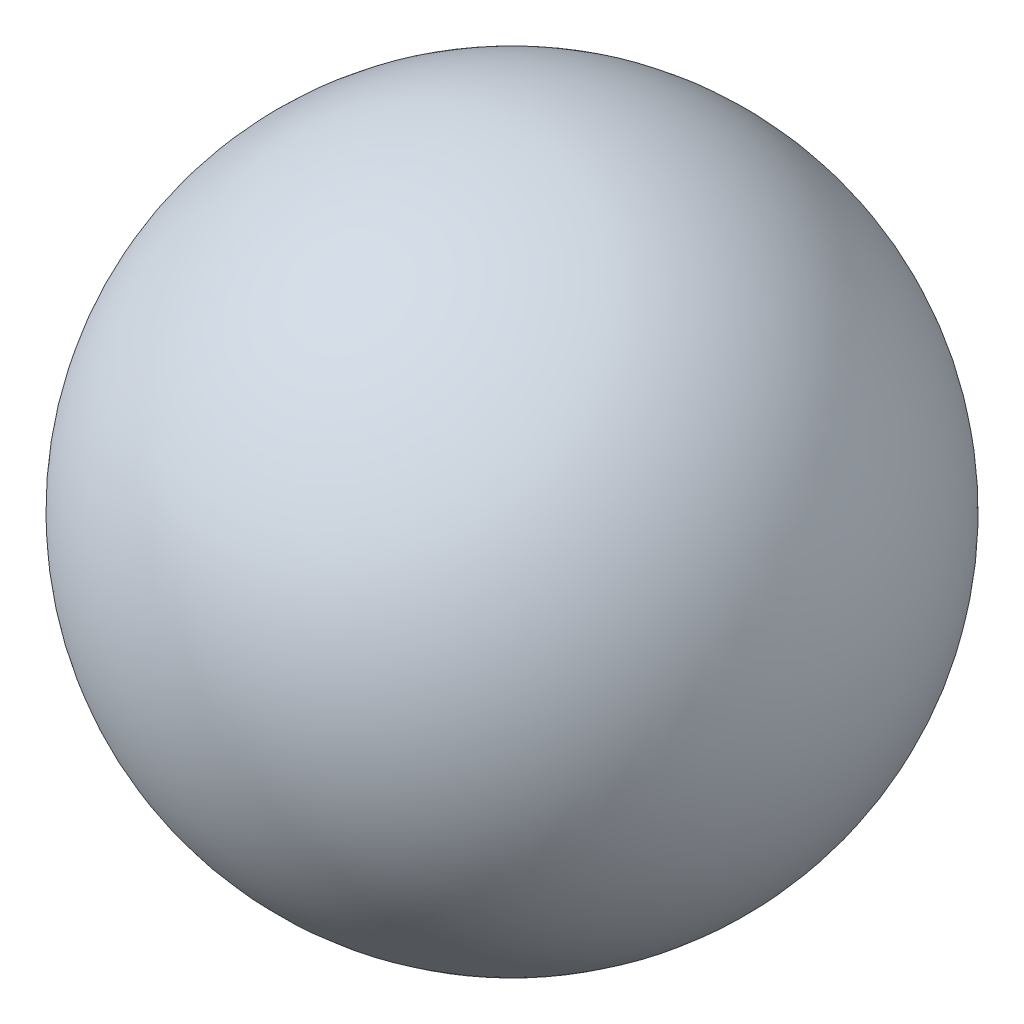
ISO-10303-21;
HEADER;
FILE_DESCRIPTION(('STEP AP214'),'2;1');
FILE_NAME('part.step','',(''),(''),'','','');
FILE_SCHEMA(('AUTOMOTIVE_DESIGN { 1 0 10303 214 1 1 1 1 }'));
ENDSEC;
DATA;
#1=APPLICATION_CONTEXT('core data for automotive mechanical design processes');
#2=APPLICATION_PROTOCOL_DEFINITION('international standard','automotive_design',2000,#1);
#3=PRODUCT_CONTEXT('',#1,'mechanical');
#4=PRODUCT('Part','Part','',(#3));
#5=PRODUCT_RELATED_PRODUCT_CATEGORY('part','',(#4));
#6=PRODUCT_DEFINITION_FORMATION('','',#4);
#7=PRODUCT_DEFINITION_CONTEXT('part definition',#1,'design');
#8=PRODUCT_DEFINITION('design','',#6,#7);
#9=PRODUCT_DEFINITION_SHAPE('','',#8);
#10=(LENGTH_UNIT() NAMED_UNIT(*) SI_UNIT(.MILLI.,.METRE.));
#11=(NAMED_UNIT(*) PLANE_ANGLE_UNIT() SI_UNIT($,.RADIAN.));
#12=(NAMED_UNIT(*) SI_UNIT($,.STERADIAN.) SOLID_ANGLE_UNIT());
#13=UNCERTAINTY_MEASURE_WITH_UNIT(LENGTH_MEASURE(1.E-05),#10,'distance_accuracy_value','');
#14=(GEOMETRIC_REPRESENTATION_CONTEXT(3) GLOBAL_UNCERTAINTY_ASSIGNED_CONTEXT((#13)) GLOBAL_UNIT_ASSIGNED_CONTEXT((#10,
#11,#12)) REPRESENTATION_CONTEXT('',''));
#15=CARTESIAN_POINT('',(0.,0.,0.));
#16=DIRECTION('',(0.,0.,1.));
#17=DIRECTION('',(1.,0.,0.));
#18=AXIS2_PLACEMENT_3D('',#15,#16,#17);
#19=CARTESIAN_POINT('',(0.,0.,0.));
#20=DIRECTION('',(0.,1.,0.));
#21=DIRECTION('',(1.,0.,0.));
#22=AXIS2_PLACEMENT_3D('',#19,#20,#21);
#23=SPHERICAL_SURFACE('',#22,40.);
#24=CARTESIAN_POINT('',(0.,-37.9967103839267,0.));
#25=DIRECTION('',(0.,1.,0.));
#26=DIRECTION('',(-1.,0.,0.));
#27=AXIS2_PLACEMENT_3D('',#24,#25,#26);
#28=CIRCLE('',#27,12.5);
#29=CARTESIAN_POINT('',(-12.5,-37.9967103839267,0.));
#30=VERTEX_POINT('',#29);
#31=EDGE_CURVE('E10',#30,#30,#28,.T.);
#32=ORIENTED_EDGE('',*,*,#31,.T.);
#33=EDGE_LOOP('',(#32));
#34=FACE_BOUND('',#33,.T.);
#35=ADVANCED_FACE('F36',(#34),#23,.T.);
#36=CARTESIAN_POINT('',(0.,-37.9967103839267,0.));
#37=DIRECTION('',(0.,1.,0.));
#38=DIRECTION('',(-1.,0.,0.));
#39=AXIS2_PLACEMENT_3D('',#36,#37,#38);
#40=PLANE('',#39);
#41=CARTESIAN_POINT('',(0.,-37.9967103839267,0.));
#42=DIRECTION('',(0.,1.,0.));
#43=DIRECTION('',(-1.,0.,0.));
#44=AXIS2_PLACEMENT_3D('',#41,#42,#43);
#45=CIRCLE('',#44,7.60345316287278);
#46=CARTESIAN_POINT('',(-7.60345316287278,-37.9967103839267,0.));
#47=VERTEX_POINT('',#46);
#48=EDGE_CURVE('E43',#47,#47,#45,.T.);
#49=ORIENTED_EDGE('',*,*,#48,.T.);
#50=EDGE_LOOP('',(#49));
#51=FACE_BOUND('',#50,.T.);
#52=ORIENTED_EDGE('',*,*,#31,.F.);
#53=EDGE_LOOP('',(#52));
#54=FACE_BOUND('',#53,.T.);
#55=ADVANCED_FACE('F50',(#51,#54),#40,.F.);
#56=CARTESIAN_POINT('',(0.,0.,0.));
#57=DIRECTION('',(0.,1.,0.));
#58=DIRECTION('',(1.,0.,0.));
#59=AXIS2_PLACEMENT_3D('',#56,#57,#58);
#60=SPHERICAL_SURFACE('',#59,38.75);
#61=ORIENTED_EDGE('',*,*,#48,.F.);
#62=EDGE_LOOP('',(#61));
#63=FACE_BOUND('',#62,.T.);
#64=ADVANCED_FACE('F53',(#63),#60,.F.);
#65=CLOSED_SHELL('',(#35,#55,#64));
#66=MANIFOLD_SOLID_BREP('B2',#65);
#67=ADVANCED_BREP_SHAPE_REPRESENTATION('',(#18,#66),#14);
#68=SHAPE_DEFINITION_REPRESENTATION(#9,#67);
ENDSEC;
END-ISO-10303-21;
